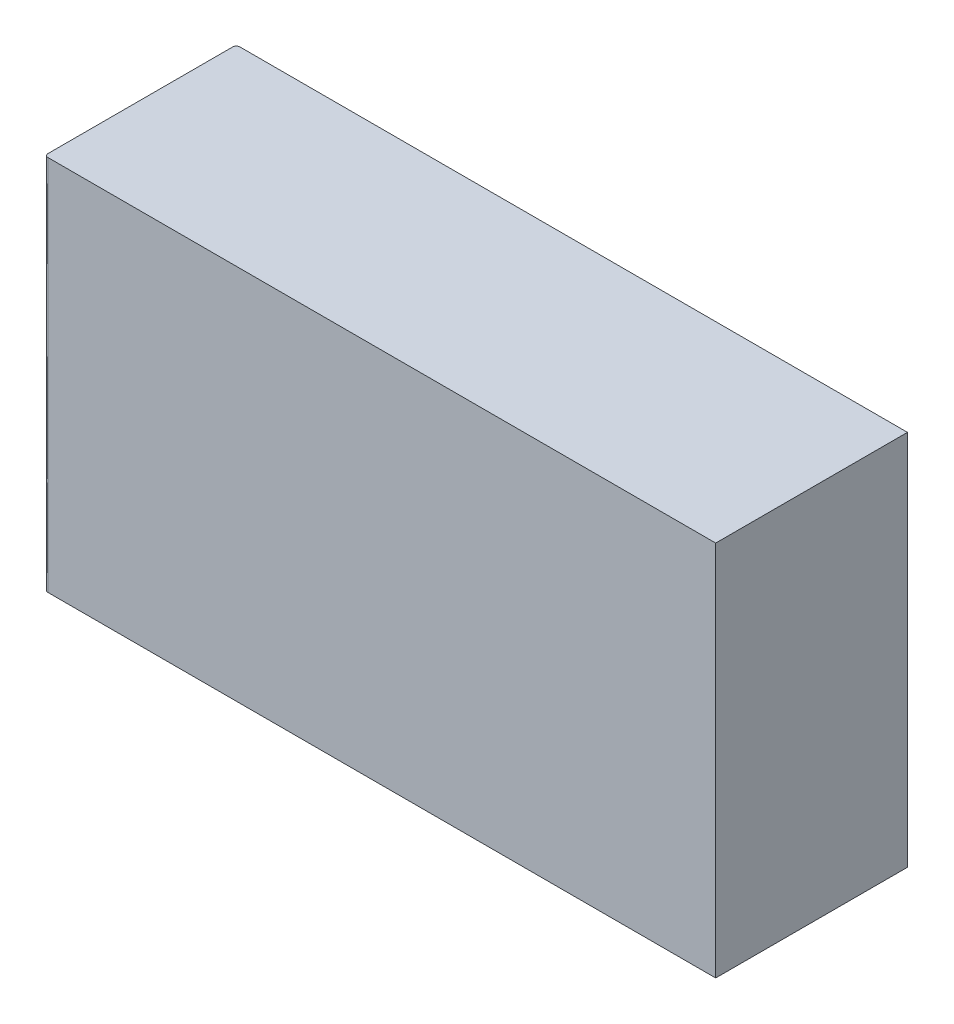
ISO-10303-21;
HEADER;
FILE_DESCRIPTION(('STEP AP214'),'2;1');
FILE_NAME('part.step','',(''),(''),'','','');
FILE_SCHEMA(('AUTOMOTIVE_DESIGN { 1 0 10303 214 1 1 1 1 }'));
ENDSEC;
DATA;
#1=APPLICATION_CONTEXT('core data for automotive mechanical design processes');
#2=APPLICATION_PROTOCOL_DEFINITION('international standard','automotive_design',2000,#1);
#3=PRODUCT_CONTEXT('',#1,'mechanical');
#4=PRODUCT('Part','Part','',(#3));
#5=PRODUCT_RELATED_PRODUCT_CATEGORY('part','',(#4));
#6=PRODUCT_DEFINITION_FORMATION('','',#4);
#7=PRODUCT_DEFINITION_CONTEXT('part definition',#1,'design');
#8=PRODUCT_DEFINITION('design','',#6,#7);
#9=PRODUCT_DEFINITION_SHAPE('','',#8);
#10=(LENGTH_UNIT() NAMED_UNIT(*) SI_UNIT(.MILLI.,.METRE.));
#11=(NAMED_UNIT(*) PLANE_ANGLE_UNIT() SI_UNIT($,.RADIAN.));
#12=(NAMED_UNIT(*) SI_UNIT($,.STERADIAN.) SOLID_ANGLE_UNIT());
#13=UNCERTAINTY_MEASURE_WITH_UNIT(LENGTH_MEASURE(1.E-05),#10,'distance_accuracy_value','');
#14=(GEOMETRIC_REPRESENTATION_CONTEXT(3) GLOBAL_UNCERTAINTY_ASSIGNED_CONTEXT((#13)) GLOBAL_UNIT_ASSIGNED_CONTEXT((#10,
#11,#12)) REPRESENTATION_CONTEXT('',''));
#15=CARTESIAN_POINT('',(0.,0.,0.));
#16=DIRECTION('',(0.,0.,1.));
#17=DIRECTION('',(1.,0.,0.));
#18=AXIS2_PLACEMENT_3D('',#15,#16,#17);
#19=CARTESIAN_POINT('',(0.035,0.,0.315));
#20=DIRECTION('',(0.,0.,1.));
#21=DIRECTION('',(1.,0.,0.));
#22=AXIS2_PLACEMENT_3D('',#19,#20,#21);
#23=PLANE('',#22);
#24=CARTESIAN_POINT('',(0.04,0.,0.315));
#25=CARTESIAN_POINT('',(0.04,0.183333358902985,0.315));
#26=CARTESIAN_POINT('',(0.04,0.366666641096023,0.315));
#27=CARTESIAN_POINT('',(0.04,0.55,0.315));
#28=(BOUNDED_CURVE() B_SPLINE_CURVE(3,(#24,#25,#26,#27),.UNSPECIFIED.,.F.,
.F.) B_SPLINE_CURVE_WITH_KNOTS((4,4),(0.,0.055),
.UNSPECIFIED.) CURVE() GEOMETRIC_REPRESENTATION_ITEM() RATIONAL_B_SPLINE_CURVE((1.,1.,1.,1.)) REPRESENTATION_ITEM(''));
#29=CARTESIAN_POINT('',(0.04,0.,0.315));
#30=VERTEX_POINT('',#29);
#31=CARTESIAN_POINT('',(0.04,0.55,0.315));
#32=VERTEX_POINT('',#31);
#33=EDGE_CURVE('E93',#30,#32,#28,.T.);
#34=ORIENTED_EDGE('',*,*,#33,.F.);
#35=DIRECTION('',(1.,0.,0.));
#36=VECTOR('',#35,1.);
#37=CARTESIAN_POINT('',(0.035,0.,0.315));
#38=LINE('',#37,#36);
#39=CARTESIAN_POINT('',(1.015,0.,0.315));
#40=VERTEX_POINT('',#39);
#41=EDGE_CURVE('E103',#30,#40,#38,.T.);
#42=ORIENTED_EDGE('',*,*,#41,.T.);
#43=DIRECTION('',(0.,1.,0.));
#44=VECTOR('',#43,1.);
#45=CARTESIAN_POINT('',(1.015,0.,0.315));
#46=LINE('',#45,#44);
#47=CARTESIAN_POINT('',(1.015,0.55,0.315));
#48=VERTEX_POINT('',#47);
#49=EDGE_CURVE('E98',#40,#48,#46,.T.);
#50=ORIENTED_EDGE('',*,*,#49,.T.);
#51=DIRECTION('',(1.,0.,0.));
#52=VECTOR('',#51,1.);
#53=CARTESIAN_POINT('',(0.035,0.55,0.315));
#54=LINE('',#53,#52);
#55=EDGE_CURVE('E28',#32,#48,#54,.T.);
#56=ORIENTED_EDGE('',*,*,#55,.F.);
#57=EDGE_LOOP('',(#34,#42,#50,#56));
#58=FACE_BOUND('',#57,.T.);
#59=ADVANCED_FACE('F17',(#58),#23,.T.);
#60=CARTESIAN_POINT('',(0.035,0.,0.035));
#61=DIRECTION('',(0.,0.,1.));
#62=DIRECTION('',(1.,0.,0.));
#63=AXIS2_PLACEMENT_3D('',#60,#61,#62);
#64=PLANE('',#63);
#65=CARTESIAN_POINT('',(0.04,0.55,0.035));
#66=CARTESIAN_POINT('',(0.04,0.366666641096023,0.035));
#67=CARTESIAN_POINT('',(0.04,0.183333358902985,0.035));
#68=CARTESIAN_POINT('',(0.04,0.,0.035));
#69=(BOUNDED_CURVE() B_SPLINE_CURVE(3,(#65,#66,#67,#68),.UNSPECIFIED.,.F.,
.F.) B_SPLINE_CURVE_WITH_KNOTS((4,4),(-0.055,0.),
.UNSPECIFIED.) CURVE() GEOMETRIC_REPRESENTATION_ITEM() RATIONAL_B_SPLINE_CURVE((1.,1.,1.,1.)) REPRESENTATION_ITEM(''));
#70=CARTESIAN_POINT('',(0.04,0.55,0.035));
#71=VERTEX_POINT('',#70);
#72=CARTESIAN_POINT('',(0.04,0.,0.035));
#73=VERTEX_POINT('',#72);
#74=EDGE_CURVE('E126',#71,#73,#69,.T.);
#75=ORIENTED_EDGE('',*,*,#74,.F.);
#76=DIRECTION('',(1.,0.,0.));
#77=VECTOR('',#76,1.);
#78=CARTESIAN_POINT('',(0.035,0.55,0.035));
#79=LINE('',#78,#77);
#80=CARTESIAN_POINT('',(1.015,0.55,0.035));
#81=VERTEX_POINT('',#80);
#82=EDGE_CURVE('E11',#71,#81,#79,.T.);
#83=ORIENTED_EDGE('',*,*,#82,.T.);
#84=DIRECTION('',(0.,1.,0.));
#85=VECTOR('',#84,1.);
#86=CARTESIAN_POINT('',(1.015,0.,0.035));
#87=LINE('',#86,#85);
#88=CARTESIAN_POINT('',(1.015,0.,0.035));
#89=VERTEX_POINT('',#88);
#90=EDGE_CURVE('E82',#89,#81,#87,.T.);
#91=ORIENTED_EDGE('',*,*,#90,.F.);
#92=DIRECTION('',(1.,0.,0.));
#93=VECTOR('',#92,1.);
#94=CARTESIAN_POINT('',(0.035,0.,0.035));
#95=LINE('',#94,#93);
#96=EDGE_CURVE('E87',#73,#89,#95,.T.);
#97=ORIENTED_EDGE('',*,*,#96,.F.);
#98=EDGE_LOOP('',(#75,#83,#91,#97));
#99=FACE_BOUND('',#98,.T.);
#100=ADVANCED_FACE('F85',(#99),#64,.F.);
#101=CARTESIAN_POINT('',(0.035,0.55,0.035));
#102=DIRECTION('',(0.,1.,0.));
#103=DIRECTION('',(1.,0.,0.));
#104=AXIS2_PLACEMENT_3D('',#101,#102,#103);
#105=PLANE('',#104);
#106=CARTESIAN_POINT('',(0.035,0.55,0.04));
#107=CARTESIAN_POINT('',(0.035,0.55,0.0389898474554478));
#108=CARTESIAN_POINT('',(0.0358182354466237,0.55,0.0362105196264358));
#109=CARTESIAN_POINT('',(0.0386531299405971,0.55,0.035));
#110=CARTESIAN_POINT('',(0.04,0.55,0.035));
#111=(BOUNDED_CURVE() B_SPLINE_CURVE(3,(#106,#107,#108,#109,#110),.UNSPECIFIED.,.F.,
.F.) B_SPLINE_CURVE_WITH_KNOTS((4,1,4),(0.,0.428571428571429,1.),
.UNSPECIFIED.) CURVE() GEOMETRIC_REPRESENTATION_ITEM() RATIONAL_B_SPLINE_CURVE((1.,1.,1.,1.,1.)) REPRESENTATION_ITEM(''));
#112=CARTESIAN_POINT('',(0.035,0.55,0.04));
#113=VERTEX_POINT('',#112);
#114=EDGE_CURVE('E129',#113,#71,#111,.T.);
#115=ORIENTED_EDGE('',*,*,#114,.F.);
#116=DIRECTION('',(0.,0.,1.));
#117=VECTOR('',#116,1.);
#118=CARTESIAN_POINT('',(0.035,0.55,0.035));
#119=LINE('',#118,#117);
#120=CARTESIAN_POINT('',(0.035,0.55,0.31));
#121=VERTEX_POINT('',#120);
#122=EDGE_CURVE('E111',#113,#121,#119,.T.);
#123=ORIENTED_EDGE('',*,*,#122,.T.);
#124=CARTESIAN_POINT('',(0.04,0.55,0.315));
#125=CARTESIAN_POINT('',(0.0389898474554478,0.55,0.315));
#126=CARTESIAN_POINT('',(0.0362106385716418,0.55,0.314181512077571));
#127=CARTESIAN_POINT('',(0.035,0.55,0.311346870059403));
#128=CARTESIAN_POINT('',(0.035,0.55,0.31));
#129=(BOUNDED_CURVE() B_SPLINE_CURVE(3,(#124,#125,#126,#127,#128),.UNSPECIFIED.,.F.,
.F.) B_SPLINE_CURVE_WITH_KNOTS((4,1,4),(0.,0.428571428571429,1.),
.UNSPECIFIED.) CURVE() GEOMETRIC_REPRESENTATION_ITEM() RATIONAL_B_SPLINE_CURVE((1.,1.,1.,1.,1.)) REPRESENTATION_ITEM(''));
#130=EDGE_CURVE('E242',#32,#121,#129,.T.);
#131=ORIENTED_EDGE('',*,*,#130,.F.);
#132=ORIENTED_EDGE('',*,*,#55,.T.);
#133=DIRECTION('',(0.,0.,1.));
#134=VECTOR('',#133,1.);
#135=CARTESIAN_POINT('',(1.015,0.55,0.035));
#136=LINE('',#135,#134);
#137=EDGE_CURVE('E92',#81,#48,#136,.T.);
#138=ORIENTED_EDGE('',*,*,#137,.F.);
#139=ORIENTED_EDGE('',*,*,#82,.F.);
#140=EDGE_LOOP('',(#115,#123,#131,#132,#138,#139));
#141=FACE_BOUND('',#140,.T.);
#142=ADVANCED_FACE('F247',(#141),#105,.T.);
#143=CARTESIAN_POINT('',(1.015,0.,0.035));
#144=DIRECTION('',(1.,0.,0.));
#145=DIRECTION('',(0.,1.,0.));
#146=AXIS2_PLACEMENT_3D('',#143,#144,#145);
#147=PLANE('',#146);
#148=DIRECTION('',(0.,0.,1.));
#149=VECTOR('',#148,1.);
#150=CARTESIAN_POINT('',(1.015,0.,0.035));
#151=LINE('',#150,#149);
#152=EDGE_CURVE('E96',#89,#40,#151,.T.);
#153=ORIENTED_EDGE('',*,*,#152,.F.);
#154=ORIENTED_EDGE('',*,*,#90,.T.);
#155=ORIENTED_EDGE('',*,*,#137,.T.);
#156=ORIENTED_EDGE('',*,*,#49,.F.);
#157=EDGE_LOOP('',(#153,#154,#155,#156));
#158=FACE_BOUND('',#157,.T.);
#159=ADVANCED_FACE('F97',(#158),#147,.T.);
#160=CARTESIAN_POINT('',(0.035,0.,0.31));
#161=CARTESIAN_POINT('',(0.035,0.183333358902985,0.31));
#162=CARTESIAN_POINT('',(0.035,0.366666641096023,0.31));
#163=CARTESIAN_POINT('',(0.035,0.55,0.31));
#164=CARTESIAN_POINT('',(0.035,0.,0.311346870059403));
#165=CARTESIAN_POINT('',(0.035,0.183333358902984,0.311346870059403));
#166=CARTESIAN_POINT('',(0.035,0.366666641096023,0.311346870059403));
#167=CARTESIAN_POINT('',(0.035,0.55,0.311346870059403));
#168=CARTESIAN_POINT('',(0.0362106385716418,0.,0.314181512077571));
#169=CARTESIAN_POINT('',(0.0362106385716418,0.183333358902985,0.314181512077571));
#170=CARTESIAN_POINT('',(0.0362106385716418,0.366666641096022,0.314181512077571));
#171=CARTESIAN_POINT('',(0.0362106385716418,0.55,0.314181512077571));
#172=CARTESIAN_POINT('',(0.0389898474554478,0.,0.315));
#173=CARTESIAN_POINT('',(0.0389898474554478,0.183333358902984,0.315));
#174=CARTESIAN_POINT('',(0.0389898474554478,0.366666641096023,0.315));
#175=CARTESIAN_POINT('',(0.0389898474554478,0.55,0.315));
#176=CARTESIAN_POINT('',(0.04,0.,0.315));
#177=CARTESIAN_POINT('',(0.04,0.183333358902985,0.315));
#178=CARTESIAN_POINT('',(0.04,0.366666641096023,0.315));
#179=CARTESIAN_POINT('',(0.04,0.55,0.315));
#180=(BOUNDED_SURFACE() B_SPLINE_SURFACE(3,3,((#160,#161,#162,#163),(#164,#165,#166,#167),(#168,
#169,#170,#171),(#172,#173,#174,#175),(#176,#177,#178,#179)),.UNSPECIFIED.,.F.,.F.,
.F.) B_SPLINE_SURFACE_WITH_KNOTS((4,1,4),(4,4),(0.,0.571428571428571,1.),(0.,0.055),
.UNSPECIFIED.) GEOMETRIC_REPRESENTATION_ITEM() RATIONAL_B_SPLINE_SURFACE(((1.,1.,1.,1.),(1.,1.,
1.,1.),(1.,1.,1.,1.),(1.,1.,1.,1.),(1.,1.,1.,1.))) REPRESENTATION_ITEM('') SURFACE());
#181=CARTESIAN_POINT('',(0.035,0.55,0.31));
#182=CARTESIAN_POINT('',(0.035,0.366666641096023,0.31));
#183=CARTESIAN_POINT('',(0.035,0.183333358902985,0.31));
#184=CARTESIAN_POINT('',(0.035,0.,0.31));
#185=(BOUNDED_CURVE() B_SPLINE_CURVE(3,(#181,#182,#183,#184),.UNSPECIFIED.,.F.,
.F.) B_SPLINE_CURVE_WITH_KNOTS((4,4),(-0.055,0.),
.UNSPECIFIED.) CURVE() GEOMETRIC_REPRESENTATION_ITEM() RATIONAL_B_SPLINE_CURVE((1.,1.,1.,1.)) REPRESENTATION_ITEM(''));
#186=CARTESIAN_POINT('',(0.035,0.,0.31));
#187=VERTEX_POINT('',#186);
#188=EDGE_CURVE('E118',#121,#187,#185,.T.);
#189=CARTESIAN_POINT('',(0.035,0.,0.31));
#190=CARTESIAN_POINT('',(0.035,0.,0.311346870059403));
#191=CARTESIAN_POINT('',(0.0362106385716418,0.,0.314181512077571));
#192=CARTESIAN_POINT('',(0.0389898474554478,0.,0.315));
#193=CARTESIAN_POINT('',(0.04,0.,0.315));
#194=(BOUNDED_CURVE() B_SPLINE_CURVE(3,(#189,#190,#191,#192,#193),.UNSPECIFIED.,.F.,
.F.) B_SPLINE_CURVE_WITH_KNOTS((4,1,4),(0.,0.571428571428571,1.),
.UNSPECIFIED.) CURVE() GEOMETRIC_REPRESENTATION_ITEM() RATIONAL_B_SPLINE_CURVE((1.,1.,1.,1.,1.)) REPRESENTATION_ITEM(''));
#195=EDGE_CURVE('E191',#187,#30,#194,.T.);
#196=ORIENTED_EDGE('',*,*,#130,.T.);
#197=ORIENTED_EDGE('',*,*,#188,.T.);
#198=ORIENTED_EDGE('',*,*,#195,.T.);
#199=ORIENTED_EDGE('',*,*,#33,.T.);
#200=EDGE_LOOP('',(#196,#197,#198,#199));
#201=FACE_BOUND('',#200,.T.);
#202=ADVANCED_FACE('F212',(#201),#180,.T.);
#203=CARTESIAN_POINT('',(0.035,0.,0.035));
#204=DIRECTION('',(0.,1.,0.));
#205=DIRECTION('',(1.,0.,0.));
#206=AXIS2_PLACEMENT_3D('',#203,#204,#205);
#207=PLANE('',#206);
#208=CARTESIAN_POINT('',(0.04,0.,0.035));
#209=CARTESIAN_POINT('',(0.0386531299405971,0.,0.035));
#210=CARTESIAN_POINT('',(0.0358182354466237,0.,0.0362105196264358));
#211=CARTESIAN_POINT('',(0.035,0.,0.0389898474554478));
#212=CARTESIAN_POINT('',(0.035,0.,0.04));
#213=(BOUNDED_CURVE() B_SPLINE_CURVE(3,(#208,#209,#210,#211,#212),.UNSPECIFIED.,.F.,
.F.) B_SPLINE_CURVE_WITH_KNOTS((4,1,4),(0.,0.571428571428571,1.),
.UNSPECIFIED.) CURVE() GEOMETRIC_REPRESENTATION_ITEM() RATIONAL_B_SPLINE_CURVE((1.,1.,1.,1.,1.)) REPRESENTATION_ITEM(''));
#214=CARTESIAN_POINT('',(0.035,0.,0.04));
#215=VERTEX_POINT('',#214);
#216=EDGE_CURVE('E107',#73,#215,#213,.T.);
#217=ORIENTED_EDGE('',*,*,#216,.F.);
#218=ORIENTED_EDGE('',*,*,#96,.T.);
#219=ORIENTED_EDGE('',*,*,#152,.T.);
#220=ORIENTED_EDGE('',*,*,#41,.F.);
#221=ORIENTED_EDGE('',*,*,#195,.F.);
#222=DIRECTION('',(0.,0.,1.));
#223=VECTOR('',#222,1.);
#224=CARTESIAN_POINT('',(0.035,0.,0.035));
#225=LINE('',#224,#223);
#226=EDGE_CURVE('E141',#215,#187,#225,.T.);
#227=ORIENTED_EDGE('',*,*,#226,.F.);
#228=EDGE_LOOP('',(#217,#218,#219,#220,#221,#227));
#229=FACE_BOUND('',#228,.T.);
#230=ADVANCED_FACE('F105',(#229),#207,.F.);
#231=CARTESIAN_POINT('',(0.035,0.,0.035));
#232=DIRECTION('',(1.,0.,0.));
#233=DIRECTION('',(0.,1.,0.));
#234=AXIS2_PLACEMENT_3D('',#231,#232,#233);
#235=PLANE('',#234);
#236=CARTESIAN_POINT('',(0.035,0.,0.04));
#237=CARTESIAN_POINT('',(0.035,0.183333358902985,0.04));
#238=CARTESIAN_POINT('',(0.035,0.366666641096023,0.04));
#239=CARTESIAN_POINT('',(0.035,0.55,0.04));
#240=(BOUNDED_CURVE() B_SPLINE_CURVE(3,(#236,#237,#238,#239),.UNSPECIFIED.,.F.,
.F.) B_SPLINE_CURVE_WITH_KNOTS((4,4),(0.,0.055),
.UNSPECIFIED.) CURVE() GEOMETRIC_REPRESENTATION_ITEM() RATIONAL_B_SPLINE_CURVE((1.,1.,1.,1.)) REPRESENTATION_ITEM(''));
#241=EDGE_CURVE('E134',#215,#113,#240,.T.);
#242=ORIENTED_EDGE('',*,*,#241,.F.);
#243=ORIENTED_EDGE('',*,*,#226,.T.);
#244=ORIENTED_EDGE('',*,*,#188,.F.);
#245=ORIENTED_EDGE('',*,*,#122,.F.);
#246=EDGE_LOOP('',(#242,#243,#244,#245));
#247=FACE_BOUND('',#246,.T.);
#248=ADVANCED_FACE('F19',(#247),#235,.F.);
#249=CARTESIAN_POINT('',(0.04,0.,0.035));
#250=CARTESIAN_POINT('',(0.04,0.183333358902985,0.035));
#251=CARTESIAN_POINT('',(0.04,0.366666641096023,0.035));
#252=CARTESIAN_POINT('',(0.04,0.55,0.035));
#253=CARTESIAN_POINT('',(0.0386531299405971,0.,0.035));
#254=CARTESIAN_POINT('',(0.0386531299405971,0.183333358902984,0.035));
#255=CARTESIAN_POINT('',(0.0386531299405971,0.366666641096023,0.035));
#256=CARTESIAN_POINT('',(0.0386531299405971,0.55,0.035));
#257=CARTESIAN_POINT('',(0.0358182354466237,0.,0.0362105196264358));
#258=CARTESIAN_POINT('',(0.0358182354466237,0.183333358902985,0.0362105196264358));
#259=CARTESIAN_POINT('',(0.0358182354466237,0.366666641096022,0.0362105196264358));
#260=CARTESIAN_POINT('',(0.0358182354466237,0.55,0.0362105196264358));
#261=CARTESIAN_POINT('',(0.035,0.,0.0389898474554478));
#262=CARTESIAN_POINT('',(0.035,0.183333358902984,0.0389898474554478));
#263=CARTESIAN_POINT('',(0.035,0.366666641096023,0.0389898474554478));
#264=CARTESIAN_POINT('',(0.035,0.55,0.0389898474554478));
#265=CARTESIAN_POINT('',(0.035,0.,0.04));
#266=CARTESIAN_POINT('',(0.035,0.183333358902985,0.04));
#267=CARTESIAN_POINT('',(0.035,0.366666641096023,0.04));
#268=CARTESIAN_POINT('',(0.035,0.55,0.04));
#269=(BOUNDED_SURFACE() B_SPLINE_SURFACE(3,3,((#249,#250,#251,#252),(#253,#254,#255,#256),(#257,
#258,#259,#260),(#261,#262,#263,#264),(#265,#266,#267,#268)),.UNSPECIFIED.,.F.,.F.,
.F.) B_SPLINE_SURFACE_WITH_KNOTS((4,1,4),(4,4),(0.,0.571428571428571,1.),(0.,0.055),
.UNSPECIFIED.) GEOMETRIC_REPRESENTATION_ITEM() RATIONAL_B_SPLINE_SURFACE(((1.,1.,1.,1.),(1.,1.,
1.,1.),(1.,1.,1.,1.),(1.,1.,1.,1.),(1.,1.,1.,1.))) REPRESENTATION_ITEM('') SURFACE());
#270=ORIENTED_EDGE('',*,*,#114,.T.);
#271=ORIENTED_EDGE('',*,*,#74,.T.);
#272=ORIENTED_EDGE('',*,*,#216,.T.);
#273=ORIENTED_EDGE('',*,*,#241,.T.);
#274=EDGE_LOOP('',(#270,#271,#272,#273));
#275=FACE_BOUND('',#274,.T.);
#276=ADVANCED_FACE('F158',(#275),#269,.T.);
#277=CLOSED_SHELL('',(#59,#100,#142,#159,#202,#230,#248,#276));
#278=MANIFOLD_SOLID_BREP('B1',#277);
#279=ADVANCED_BREP_SHAPE_REPRESENTATION('',(#18,#278),#14);
#280=SHAPE_DEFINITION_REPRESENTATION(#9,#279);
ENDSEC;
END-ISO-10303-21;
